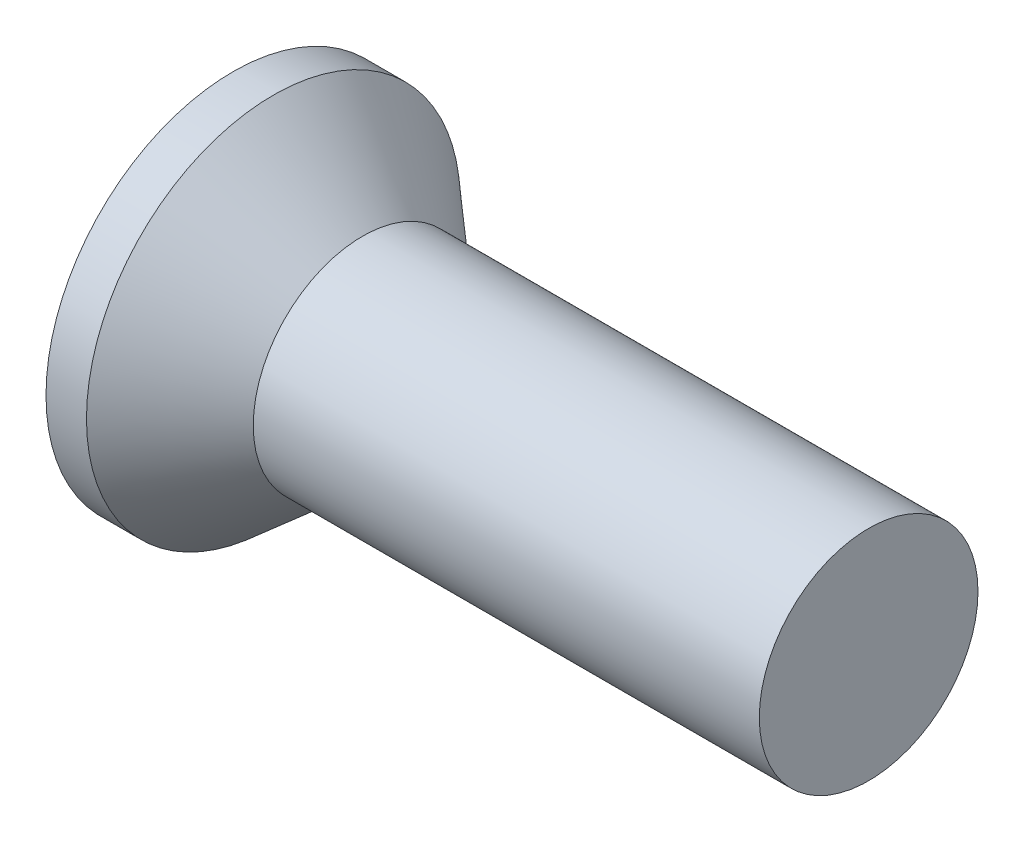
ISO-10303-21;
HEADER;
FILE_DESCRIPTION(('STEP AP214'),'2;1');
FILE_NAME('part.step','',(''),(''),'','','');
FILE_SCHEMA(('AUTOMOTIVE_DESIGN { 1 0 10303 214 1 1 1 1 }'));
ENDSEC;
DATA;
#1=APPLICATION_CONTEXT('core data for automotive mechanical design processes');
#2=APPLICATION_PROTOCOL_DEFINITION('international standard','automotive_design',2000,#1);
#3=PRODUCT_CONTEXT('',#1,'mechanical');
#4=PRODUCT('Part','Part','',(#3));
#5=PRODUCT_RELATED_PRODUCT_CATEGORY('part','',(#4));
#6=PRODUCT_DEFINITION_FORMATION('','',#4);
#7=PRODUCT_DEFINITION_CONTEXT('part definition',#1,'design');
#8=PRODUCT_DEFINITION('design','',#6,#7);
#9=PRODUCT_DEFINITION_SHAPE('','',#8);
#10=(LENGTH_UNIT() NAMED_UNIT(*) SI_UNIT(.MILLI.,.METRE.));
#11=(NAMED_UNIT(*) PLANE_ANGLE_UNIT() SI_UNIT($,.RADIAN.));
#12=(NAMED_UNIT(*) SI_UNIT($,.STERADIAN.) SOLID_ANGLE_UNIT());
#13=UNCERTAINTY_MEASURE_WITH_UNIT(LENGTH_MEASURE(1.E-05),#10,'distance_accuracy_value','');
#14=(GEOMETRIC_REPRESENTATION_CONTEXT(3) GLOBAL_UNCERTAINTY_ASSIGNED_CONTEXT((#13)) GLOBAL_UNIT_ASSIGNED_CONTEXT((#10,
#11,#12)) REPRESENTATION_CONTEXT('',''));
#15=CARTESIAN_POINT('',(0.,0.,0.));
#16=DIRECTION('',(0.,0.,1.));
#17=DIRECTION('',(1.,0.,0.));
#18=AXIS2_PLACEMENT_3D('',#15,#16,#17);
#19=CARTESIAN_POINT('',(0.,0.,0.));
#20=DIRECTION('',(-1.,0.,0.));
#21=DIRECTION('',(0.,0.,1.));
#22=AXIS2_PLACEMENT_3D('',#19,#20,#21);
#23=PLANE('',#22);
#24=CARTESIAN_POINT('',(0.,0.,0.));
#25=DIRECTION('',(-1.,0.,0.));
#26=DIRECTION('',(0.,0.,1.));
#27=AXIS2_PLACEMENT_3D('',#24,#25,#26);
#28=CIRCLE('',#27,1.8669);
#29=CARTESIAN_POINT('',(0.,0.,1.8669));
#30=VERTEX_POINT('',#29);
#31=EDGE_CURVE('E40',#30,#30,#28,.T.);
#32=ORIENTED_EDGE('',*,*,#31,.T.);
#33=EDGE_LOOP('',(#32));
#34=FACE_BOUND('',#33,.T.);
#35=DIRECTION('',(0.,1.,0.));
#36=VECTOR('',#35,1.);
#37=CARTESIAN_POINT('',(0.,-1.524,-0.3429));
#38=LINE('',#37,#36);
#39=CARTESIAN_POINT('',(0.,-1.524,-0.3429));
#40=VERTEX_POINT('',#39);
#41=CARTESIAN_POINT('',(0.,-0.342899999999999,-0.3429));
#42=VERTEX_POINT('',#41);
#43=EDGE_CURVE('E101',#40,#42,#38,.T.);
#44=ORIENTED_EDGE('',*,*,#43,.T.);
#45=DIRECTION('',(0.,0.,-1.));
#46=VECTOR('',#45,1.);
#47=CARTESIAN_POINT('',(0.,-0.342900000000005,1.524));
#48=LINE('',#47,#46);
#49=CARTESIAN_POINT('',(0.,-0.342899999999995,-1.524));
#50=VERTEX_POINT('',#49);
#51=EDGE_CURVE('E81',#42,#50,#48,.T.);
#52=ORIENTED_EDGE('',*,*,#51,.T.);
#53=DIRECTION('',(0.,1.,0.));
#54=VECTOR('',#53,1.);
#55=CARTESIAN_POINT('',(0.,-0.342899999999995,-1.524));
#56=LINE('',#55,#54);
#57=CARTESIAN_POINT('',(0.,0.342900000000005,-1.524));
#58=VERTEX_POINT('',#57);
#59=EDGE_CURVE('E336',#50,#58,#56,.T.);
#60=ORIENTED_EDGE('',*,*,#59,.T.);
#61=DIRECTION('',(0.,0.,1.));
#62=VECTOR('',#61,1.);
#63=CARTESIAN_POINT('',(0.,0.342900000000005,-1.524));
#64=LINE('',#63,#62);
#65=CARTESIAN_POINT('',(0.,0.342900000000001,-0.342899999999999));
#66=VERTEX_POINT('',#65);
#67=EDGE_CURVE('E97',#58,#66,#64,.T.);
#68=ORIENTED_EDGE('',*,*,#67,.T.);
#69=CARTESIAN_POINT('',(0.,1.524,-0.3429));
#70=VERTEX_POINT('',#69);
#71=EDGE_CURVE('E91',#66,#70,#38,.T.);
#72=ORIENTED_EDGE('',*,*,#71,.T.);
#73=DIRECTION('',(0.,0.,1.));
#74=VECTOR('',#73,1.);
#75=CARTESIAN_POINT('',(0.,1.524,-0.3429));
#76=LINE('',#75,#74);
#77=CARTESIAN_POINT('',(0.,1.524,0.3429));
#78=VERTEX_POINT('',#77);
#79=EDGE_CURVE('E94',#70,#78,#76,.T.);
#80=ORIENTED_EDGE('',*,*,#79,.T.);
#81=DIRECTION('',(0.,-1.,0.));
#82=VECTOR('',#81,1.);
#83=CARTESIAN_POINT('',(0.,1.524,0.3429));
#84=LINE('',#83,#82);
#85=CARTESIAN_POINT('',(0.,0.342899999999998,0.3429));
#86=VERTEX_POINT('',#85);
#87=EDGE_CURVE('E348',#78,#86,#84,.T.);
#88=ORIENTED_EDGE('',*,*,#87,.T.);
#89=CARTESIAN_POINT('',(0.,0.342899999999994,1.524));
#90=VERTEX_POINT('',#89);
#91=EDGE_CURVE('E331',#86,#90,#64,.T.);
#92=ORIENTED_EDGE('',*,*,#91,.T.);
#93=DIRECTION('',(0.,-1.,0.));
#94=VECTOR('',#93,1.);
#95=CARTESIAN_POINT('',(0.,0.342899999999994,1.524));
#96=LINE('',#95,#94);
#97=CARTESIAN_POINT('',(0.,-0.342900000000005,1.524));
#98=VERTEX_POINT('',#97);
#99=EDGE_CURVE('E317',#90,#98,#96,.T.);
#100=ORIENTED_EDGE('',*,*,#99,.T.);
#101=CARTESIAN_POINT('',(0.,-0.342900000000001,0.3429));
#102=VERTEX_POINT('',#101);
#103=EDGE_CURVE('E329',#98,#102,#48,.T.);
#104=ORIENTED_EDGE('',*,*,#103,.T.);
#105=CARTESIAN_POINT('',(0.,-1.524,0.3429));
#106=VERTEX_POINT('',#105);
#107=EDGE_CURVE('E107',#102,#106,#84,.T.);
#108=ORIENTED_EDGE('',*,*,#107,.T.);
#109=DIRECTION('',(0.,0.,-1.));
#110=VECTOR('',#109,1.);
#111=CARTESIAN_POINT('',(0.,-1.524,0.3429));
#112=LINE('',#111,#110);
#113=EDGE_CURVE('E130',#106,#40,#112,.T.);
#114=ORIENTED_EDGE('',*,*,#113,.T.);
#115=EDGE_LOOP('',(#44,#52,#60,#68,#72,#80,#88,#92,#100,#104,#108,#114));
#116=FACE_BOUND('',#115,.T.);
#117=ADVANCED_FACE('F33',(#34,#116),#23,.T.);
#118=CARTESIAN_POINT('',(1.8889014084507,0.,0.149716901408451));
#119=DIRECTION('',(-0.10174201540996,0.,-0.99481081734183));
#120=DIRECTION('',(-0.99481081734183,0.,0.10174201540996));
#121=AXIS2_PLACEMENT_3D('',#118,#119,#120);
#122=PLANE('',#121);
#123=ORIENTED_EDGE('',*,*,#107,.F.);
#124=DIRECTION('',(0.989701588102974,0.101219480601441,-0.101219480601441));
#125=VECTOR('',#124,1.);
#126=CARTESIAN_POINT('',(1.90389961056498,-0.148182994374036,0.148182994374036));
#127=LINE('',#126,#125);
#128=CARTESIAN_POINT('',(1.6764,-0.171450000000001,0.17145));
#129=VERTEX_POINT('',#128);
#130=EDGE_CURVE('E125',#102,#129,#127,.T.);
#131=ORIENTED_EDGE('',*,*,#130,.T.);
#132=DIRECTION('',(0.775819870407917,0.625945577260933,-0.0793452140189916));
#133=VECTOR('',#132,1.);
#134=CARTESIAN_POINT('',(0.,-1.524,0.3429));
#135=LINE('',#134,#133);
#136=EDGE_CURVE('E102',#106,#129,#135,.T.);
#137=ORIENTED_EDGE('',*,*,#136,.F.);
#138=EDGE_LOOP('',(#123,#131,#137));
#139=FACE_BOUND('',#138,.T.);
#140=ADVANCED_FACE('F153',(#139),#122,.T.);
#141=DIRECTION('',(0.775819870407917,-0.625945577260933,-0.0793452140189915));
#142=VECTOR('',#141,1.);
#143=CARTESIAN_POINT('',(0.,1.524,0.3429));
#144=LINE('',#143,#142);
#145=CARTESIAN_POINT('',(1.6764,0.17145,0.17145));
#146=VERTEX_POINT('',#145);
#147=EDGE_CURVE('E47',#78,#146,#144,.T.);
#148=ORIENTED_EDGE('',*,*,#147,.T.);
#149=DIRECTION('',(-0.989701588102974,0.10121948060144,0.101219480601441));
#150=VECTOR('',#149,1.);
#151=CARTESIAN_POINT('',(1.90389961056498,0.148182994374035,0.148182994374036));
#152=LINE('',#151,#150);
#153=EDGE_CURVE('E344',#146,#86,#152,.T.);
#154=ORIENTED_EDGE('',*,*,#153,.T.);
#155=ORIENTED_EDGE('',*,*,#87,.F.);
#156=EDGE_LOOP('',(#148,#154,#155));
#157=FACE_BOUND('',#156,.T.);
#158=ADVANCED_FACE('F157',(#157),#122,.T.);
#159=CARTESIAN_POINT('',(1.8889014084507,0.,-0.149716901408451));
#160=DIRECTION('',(-0.10174201540996,0.,0.99481081734183));
#161=DIRECTION('',(0.99481081734183,0.,0.10174201540996));
#162=AXIS2_PLACEMENT_3D('',#159,#160,#161);
#163=PLANE('',#162);
#164=DIRECTION('',(0.775819870407917,0.625945577260933,0.0793452140189914));
#165=VECTOR('',#164,1.);
#166=CARTESIAN_POINT('',(0.,-1.524,-0.3429));
#167=LINE('',#166,#165);
#168=CARTESIAN_POINT('',(1.6764,-0.171449999999999,-0.171450000000001));
#169=VERTEX_POINT('',#168);
#170=EDGE_CURVE('E56',#40,#169,#167,.T.);
#171=ORIENTED_EDGE('',*,*,#170,.T.);
#172=DIRECTION('',(-0.989701588102974,-0.10121948060144,-0.10121948060144));
#173=VECTOR('',#172,1.);
#174=CARTESIAN_POINT('',(1.90389961056498,-0.148182994374035,-0.148182994374036));
#175=LINE('',#174,#173);
#176=EDGE_CURVE('E11',#169,#42,#175,.T.);
#177=ORIENTED_EDGE('',*,*,#176,.T.);
#178=ORIENTED_EDGE('',*,*,#43,.F.);
#179=EDGE_LOOP('',(#171,#177,#178));
#180=FACE_BOUND('',#179,.T.);
#181=ADVANCED_FACE('F150',(#180),#163,.T.);
#182=ORIENTED_EDGE('',*,*,#71,.F.);
#183=DIRECTION('',(0.989701588102974,-0.101219480601441,0.10121948060144));
#184=VECTOR('',#183,1.);
#185=CARTESIAN_POINT('',(1.90389961056498,0.148182994374036,-0.148182994374036));
#186=LINE('',#185,#184);
#187=CARTESIAN_POINT('',(1.6764,0.17145,-0.17145));
#188=VERTEX_POINT('',#187);
#189=EDGE_CURVE('E110',#66,#188,#186,.T.);
#190=ORIENTED_EDGE('',*,*,#189,.T.);
#191=DIRECTION('',(0.775819870407917,-0.625945577260933,0.0793452140189914));
#192=VECTOR('',#191,1.);
#193=CARTESIAN_POINT('',(0.,1.524,-0.3429));
#194=LINE('',#193,#192);
#195=EDGE_CURVE('E106',#70,#188,#194,.T.);
#196=ORIENTED_EDGE('',*,*,#195,.F.);
#197=EDGE_LOOP('',(#182,#190,#196));
#198=FACE_BOUND('',#197,.T.);
#199=ADVANCED_FACE('F109',(#198),#163,.T.);
#200=CARTESIAN_POINT('',(-6.34999999999999,0.,0.));
#201=DIRECTION('',(-1.,0.,0.));
#202=DIRECTION('',(0.,0.,1.));
#203=AXIS2_PLACEMENT_3D('',#200,#201,#202);
#204=CYLINDRICAL_SURFACE('',#203,1.8669);
#205=CARTESIAN_POINT('',(0.404209594925887,0.,0.));
#206=DIRECTION('',(-1.,0.,0.));
#207=DIRECTION('',(0.,0.,1.));
#208=AXIS2_PLACEMENT_3D('',#205,#206,#207);
#209=CIRCLE('',#208,1.8669);
#210=CARTESIAN_POINT('',(0.404209594925887,0.,1.8669));
#211=VERTEX_POINT('',#210);
#212=EDGE_CURVE('E133',#211,#211,#209,.T.);
#213=ORIENTED_EDGE('',*,*,#212,.T.);
#214=EDGE_LOOP('',(#213));
#215=FACE_BOUND('',#214,.T.);
#216=ORIENTED_EDGE('',*,*,#31,.F.);
#217=EDGE_LOOP('',(#216));
#218=FACE_BOUND('',#217,.T.);
#219=ADVANCED_FACE('F139',(#215,#218),#204,.T.);
#220=CARTESIAN_POINT('',(0.404209594925887,0.,0.));
#221=DIRECTION('',(-1.,0.,0.));
#222=DIRECTION('',(0.,0.,1.));
#223=AXIS2_PLACEMENT_3D('',#220,#221,#222);
#224=CONICAL_SURFACE('',#223,1.8669,0.715584993317677);
#225=CARTESIAN_POINT('',(1.2954,0.,0.));
#226=DIRECTION('',(-1.,0.,0.));
#227=DIRECTION('',(0.,0.,1.));
#228=AXIS2_PLACEMENT_3D('',#225,#226,#227);
#229=CIRCLE('',#228,1.0922);
#230=CARTESIAN_POINT('',(1.2954,0.,1.0922));
#231=VERTEX_POINT('',#230);
#232=EDGE_CURVE('E129',#231,#231,#229,.T.);
#233=ORIENTED_EDGE('',*,*,#232,.T.);
#234=EDGE_LOOP('',(#233));
#235=FACE_BOUND('',#234,.T.);
#236=ORIENTED_EDGE('',*,*,#212,.F.);
#237=EDGE_LOOP('',(#236));
#238=FACE_BOUND('',#237,.T.);
#239=ADVANCED_FACE('F141',(#235,#238),#224,.T.);
#240=CARTESIAN_POINT('',(-6.34999999999999,0.,0.));
#241=DIRECTION('',(-1.,0.,0.));
#242=DIRECTION('',(0.,0.,1.));
#243=AXIS2_PLACEMENT_3D('',#240,#241,#242);
#244=CYLINDRICAL_SURFACE('',#243,1.0922);
#245=CARTESIAN_POINT('',(6.35,0.,0.));
#246=DIRECTION('',(-1.,0.,0.));
#247=DIRECTION('',(0.,0.,1.));
#248=AXIS2_PLACEMENT_3D('',#245,#246,#247);
#249=CIRCLE('',#248,1.0922);
#250=CARTESIAN_POINT('',(6.35,0.,1.0922));
#251=VERTEX_POINT('',#250);
#252=EDGE_CURVE('E126',#251,#251,#249,.T.);
#253=ORIENTED_EDGE('',*,*,#252,.T.);
#254=EDGE_LOOP('',(#253));
#255=FACE_BOUND('',#254,.T.);
#256=ORIENTED_EDGE('',*,*,#232,.F.);
#257=EDGE_LOOP('',(#256));
#258=FACE_BOUND('',#257,.T.);
#259=ADVANCED_FACE('F147',(#255,#258),#244,.T.);
#260=CARTESIAN_POINT('',(6.35,1.0922,0.));
#261=DIRECTION('',(1.,0.,0.));
#262=DIRECTION('',(0.,0.,-1.));
#263=AXIS2_PLACEMENT_3D('',#260,#261,#262);
#264=PLANE('',#263);
#265=ORIENTED_EDGE('',*,*,#252,.F.);
#266=EDGE_LOOP('',(#265));
#267=FACE_BOUND('',#266,.T.);
#268=ADVANCED_FACE('F177',(#267),#264,.T.);
#269=CARTESIAN_POINT('',(1.6764,-0.17145,-0.17145));
#270=DIRECTION('',(-1.,0.,0.));
#271=DIRECTION('',(0.,0.,1.));
#272=AXIS2_PLACEMENT_3D('',#269,#270,#271);
#273=PLANE('',#272);
#274=DIRECTION('',(0.,1.,0.));
#275=VECTOR('',#274,1.);
#276=CARTESIAN_POINT('',(1.6764,-0.17145,-0.17145));
#277=LINE('',#276,#275);
#278=EDGE_CURVE('E121',#169,#188,#277,.T.);
#279=ORIENTED_EDGE('',*,*,#278,.F.);
#280=DIRECTION('',(0.,0.,-1.));
#281=VECTOR('',#280,1.);
#282=CARTESIAN_POINT('',(1.6764,-0.17145,0.17145));
#283=LINE('',#282,#281);
#284=EDGE_CURVE('E112',#129,#169,#283,.T.);
#285=ORIENTED_EDGE('',*,*,#284,.F.);
#286=DIRECTION('',(0.,-1.,0.));
#287=VECTOR('',#286,1.);
#288=CARTESIAN_POINT('',(1.6764,0.17145,0.17145));
#289=LINE('',#288,#287);
#290=EDGE_CURVE('E115',#146,#129,#289,.T.);
#291=ORIENTED_EDGE('',*,*,#290,.F.);
#292=DIRECTION('',(0.,0.,1.));
#293=VECTOR('',#292,1.);
#294=CARTESIAN_POINT('',(1.6764,0.17145,-0.17145));
#295=LINE('',#294,#293);
#296=EDGE_CURVE('E119',#188,#146,#295,.T.);
#297=ORIENTED_EDGE('',*,*,#296,.F.);
#298=EDGE_LOOP('',(#279,#285,#291,#297));
#299=FACE_BOUND('',#298,.T.);
#300=ADVANCED_FACE('F174',(#299),#273,.T.);
#301=CARTESIAN_POINT('',(1.6764,-0.17145,-0.17145));
#302=DIRECTION('',(-0.627925301137923,0.778273612677989,0.));
#303=DIRECTION('',(-0.778273612677989,-0.627925301137923,0.));
#304=AXIS2_PLACEMENT_3D('',#301,#302,#303);
#305=PLANE('',#304);
#306=ORIENTED_EDGE('',*,*,#170,.F.);
#307=ORIENTED_EDGE('',*,*,#113,.F.);
#308=ORIENTED_EDGE('',*,*,#136,.T.);
#309=ORIENTED_EDGE('',*,*,#284,.T.);
#310=EDGE_LOOP('',(#306,#307,#308,#309));
#311=FACE_BOUND('',#310,.T.);
#312=ADVANCED_FACE('F166',(#311),#305,.T.);
#313=CARTESIAN_POINT('',(0.,1.524,0.3429));
#314=DIRECTION('',(-0.627925301137923,-0.778273612677989,0.));
#315=DIRECTION('',(0.778273612677989,-0.627925301137923,0.));
#316=AXIS2_PLACEMENT_3D('',#313,#314,#315);
#317=PLANE('',#316);
#318=ORIENTED_EDGE('',*,*,#147,.F.);
#319=ORIENTED_EDGE('',*,*,#79,.F.);
#320=ORIENTED_EDGE('',*,*,#195,.T.);
#321=ORIENTED_EDGE('',*,*,#296,.T.);
#322=EDGE_LOOP('',(#318,#319,#320,#321));
#323=FACE_BOUND('',#322,.T.);
#324=ADVANCED_FACE('F105',(#323),#317,.T.);
#325=CARTESIAN_POINT('',(1.8889014084507,-0.149716901408451,0.));
#326=DIRECTION('',(-0.10174201540996,0.99481081734183,0.));
#327=DIRECTION('',(-0.99481081734183,-0.10174201540996,0.));
#328=AXIS2_PLACEMENT_3D('',#325,#326,#327);
#329=PLANE('',#328);
#330=DIRECTION('',(0.775819870407917,0.0793452140189894,0.625945577260933));
#331=VECTOR('',#330,1.);
#332=CARTESIAN_POINT('',(0.,-0.342899999999995,-1.524));
#333=LINE('',#332,#331);
#334=EDGE_CURVE('E338',#50,#169,#333,.T.);
#335=ORIENTED_EDGE('',*,*,#334,.F.);
#336=ORIENTED_EDGE('',*,*,#51,.F.);
#337=ORIENTED_EDGE('',*,*,#176,.F.);
#338=EDGE_LOOP('',(#335,#336,#337));
#339=FACE_BOUND('',#338,.T.);
#340=ADVANCED_FACE('F173',(#339),#329,.T.);
#341=CARTESIAN_POINT('',(1.8889014084507,0.149716901408451,0.));
#342=DIRECTION('',(-0.10174201540996,-0.99481081734183,0.));
#343=DIRECTION('',(0.99481081734183,-0.10174201540996,0.));
#344=AXIS2_PLACEMENT_3D('',#341,#342,#343);
#345=PLANE('',#344);
#346=ORIENTED_EDGE('',*,*,#67,.F.);
#347=DIRECTION('',(0.775819870407917,-0.0793452140189935,0.625945577260933));
#348=VECTOR('',#347,1.);
#349=CARTESIAN_POINT('',(0.,0.342900000000005,-1.524));
#350=LINE('',#349,#348);
#351=EDGE_CURVE('E72',#58,#188,#350,.T.);
#352=ORIENTED_EDGE('',*,*,#351,.T.);
#353=ORIENTED_EDGE('',*,*,#189,.F.);
#354=EDGE_LOOP('',(#346,#352,#353));
#355=FACE_BOUND('',#354,.T.);
#356=ADVANCED_FACE('F217',(#355),#345,.T.);
#357=CARTESIAN_POINT('',(1.6764,0.171450000000001,-0.171449999999999));
#358=DIRECTION('',(-0.627925301137923,0.,0.778273612677989));
#359=DIRECTION('',(-0.778273612677989,0.,-0.627925301137923));
#360=AXIS2_PLACEMENT_3D('',#357,#358,#359);
#361=PLANE('',#360);
#362=ORIENTED_EDGE('',*,*,#351,.F.);
#363=ORIENTED_EDGE('',*,*,#59,.F.);
#364=ORIENTED_EDGE('',*,*,#334,.T.);
#365=ORIENTED_EDGE('',*,*,#278,.T.);
#366=EDGE_LOOP('',(#362,#363,#364,#365));
#367=FACE_BOUND('',#366,.T.);
#368=ADVANCED_FACE('F225',(#367),#361,.T.);
#369=ORIENTED_EDGE('',*,*,#103,.F.);
#370=DIRECTION('',(0.775819870407917,0.0793452140189936,-0.625945577260933));
#371=VECTOR('',#370,1.);
#372=CARTESIAN_POINT('',(0.,-0.342900000000005,1.524));
#373=LINE('',#372,#371);
#374=EDGE_CURVE('E314',#98,#129,#373,.T.);
#375=ORIENTED_EDGE('',*,*,#374,.T.);
#376=ORIENTED_EDGE('',*,*,#130,.F.);
#377=EDGE_LOOP('',(#369,#375,#376));
#378=FACE_BOUND('',#377,.T.);
#379=ADVANCED_FACE('F219',(#378),#329,.T.);
#380=DIRECTION('',(0.775819870407917,-0.0793452140189892,-0.625945577260933));
#381=VECTOR('',#380,1.);
#382=CARTESIAN_POINT('',(0.,0.342899999999994,1.524));
#383=LINE('',#382,#381);
#384=EDGE_CURVE('E325',#90,#146,#383,.T.);
#385=ORIENTED_EDGE('',*,*,#384,.F.);
#386=ORIENTED_EDGE('',*,*,#91,.F.);
#387=ORIENTED_EDGE('',*,*,#153,.F.);
#388=EDGE_LOOP('',(#385,#386,#387));
#389=FACE_BOUND('',#388,.T.);
#390=ADVANCED_FACE('F227',(#389),#345,.T.);
#391=CARTESIAN_POINT('',(0.,-0.342900000000005,1.524));
#392=DIRECTION('',(-0.627925301137923,0.,-0.778273612677989));
#393=DIRECTION('',(0.778273612677989,0.,-0.627925301137923));
#394=AXIS2_PLACEMENT_3D('',#391,#392,#393);
#395=PLANE('',#394);
#396=ORIENTED_EDGE('',*,*,#374,.F.);
#397=ORIENTED_EDGE('',*,*,#99,.F.);
#398=ORIENTED_EDGE('',*,*,#384,.T.);
#399=ORIENTED_EDGE('',*,*,#290,.T.);
#400=EDGE_LOOP('',(#396,#397,#398,#399));
#401=FACE_BOUND('',#400,.T.);
#402=ADVANCED_FACE('F246',(#401),#395,.T.);
#403=CLOSED_SHELL('',(#117,#140,#158,#181,#199,#219,#239,#259,#268,#300,#312,#324,#340,#356,
#368,#379,#390,#402));
#404=MANIFOLD_SOLID_BREP('B2',#403);
#405=ADVANCED_BREP_SHAPE_REPRESENTATION('',(#18,#404),#14);
#406=SHAPE_DEFINITION_REPRESENTATION(#9,#405);
ENDSEC;
END-ISO-10303-21;
